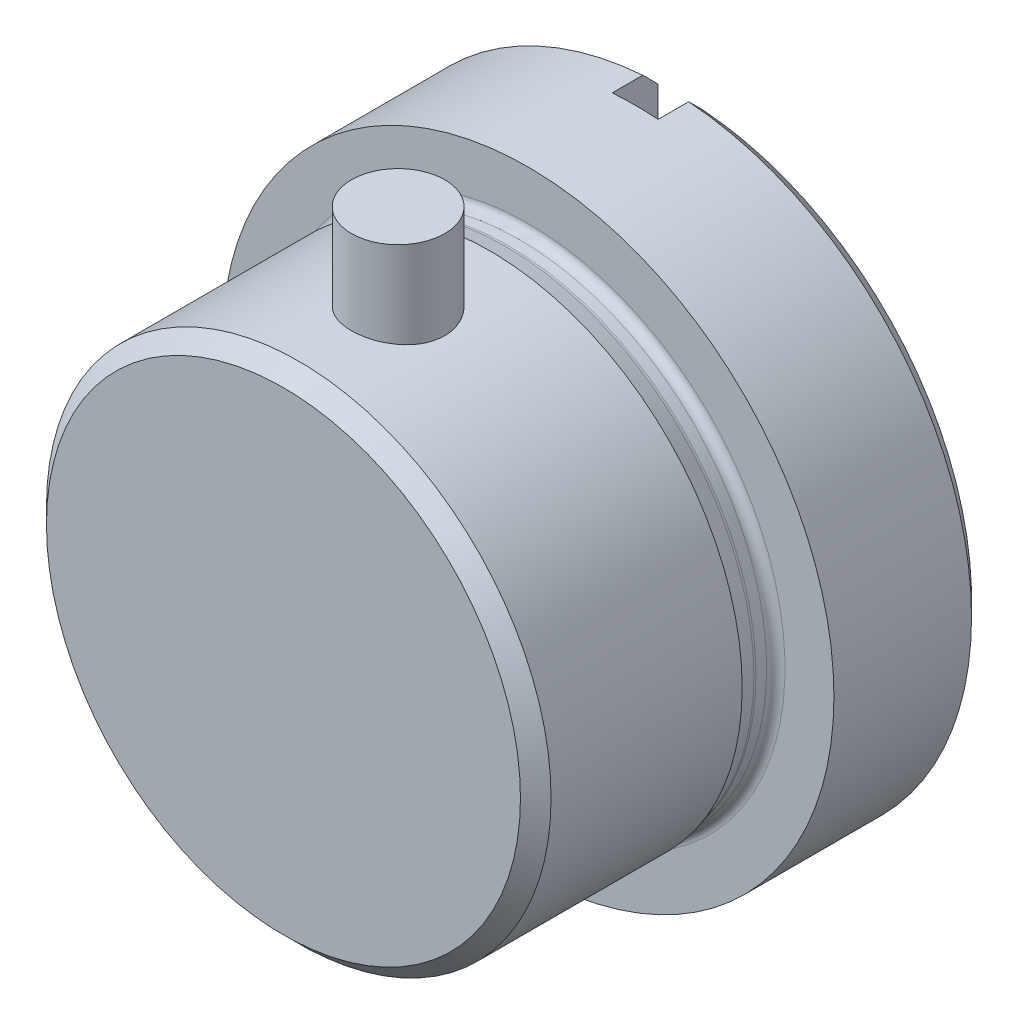
ISO-10303-21;
HEADER;
FILE_DESCRIPTION(('STEP AP214'),'2;1');
FILE_NAME('part.step','',(''),(''),'','','');
FILE_SCHEMA(('AUTOMOTIVE_DESIGN { 1 0 10303 214 1 1 1 1 }'));
ENDSEC;
DATA;
#1=APPLICATION_CONTEXT('core data for automotive mechanical design processes');
#2=APPLICATION_PROTOCOL_DEFINITION('international standard','automotive_design',2000,#1);
#3=PRODUCT_CONTEXT('',#1,'mechanical');
#4=PRODUCT('Part','Part','',(#3));
#5=PRODUCT_RELATED_PRODUCT_CATEGORY('part','',(#4));
#6=PRODUCT_DEFINITION_FORMATION('','',#4);
#7=PRODUCT_DEFINITION_CONTEXT('part definition',#1,'design');
#8=PRODUCT_DEFINITION('design','',#6,#7);
#9=PRODUCT_DEFINITION_SHAPE('','',#8);
#10=(LENGTH_UNIT() NAMED_UNIT(*) SI_UNIT(.MILLI.,.METRE.));
#11=(NAMED_UNIT(*) PLANE_ANGLE_UNIT() SI_UNIT($,.RADIAN.));
#12=(NAMED_UNIT(*) SI_UNIT($,.STERADIAN.) SOLID_ANGLE_UNIT());
#13=UNCERTAINTY_MEASURE_WITH_UNIT(LENGTH_MEASURE(1.E-05),#10,'distance_accuracy_value','');
#14=(GEOMETRIC_REPRESENTATION_CONTEXT(3) GLOBAL_UNCERTAINTY_ASSIGNED_CONTEXT((#13)) GLOBAL_UNIT_ASSIGNED_CONTEXT((#10,
#11,#12)) REPRESENTATION_CONTEXT('',''));
#15=CARTESIAN_POINT('',(0.,0.,0.));
#16=DIRECTION('',(0.,0.,1.));
#17=DIRECTION('',(1.,0.,0.));
#18=AXIS2_PLACEMENT_3D('',#15,#16,#17);
#19=CARTESIAN_POINT('',(0.,11.,-7.5));
#20=DIRECTION('',(0.,1.,0.));
#21=DIRECTION('',(0.,0.,1.));
#22=AXIS2_PLACEMENT_3D('',#19,#20,#21);
#23=CYLINDRICAL_SURFACE('',#22,3.05);
#24=CARTESIAN_POINT('',(0.,11.,-7.5));
#25=DIRECTION('',(0.,1.,0.));
#26=DIRECTION('',(0.,0.,1.));
#27=AXIS2_PLACEMENT_3D('',#24,#25,#26);
#28=CIRCLE('',#27,3.05);
#29=CARTESIAN_POINT('',(0.,11.,-4.45));
#30=VERTEX_POINT('',#29);
#31=EDGE_CURVE('E11',#30,#30,#28,.T.);
#32=ORIENTED_EDGE('',*,*,#31,.T.);
#33=EDGE_LOOP('',(#32));
#34=FACE_BOUND('',#33,.T.);
#35=CARTESIAN_POINT('',(0.,22.,-7.5));
#36=DIRECTION('',(0.,1.,0.));
#37=DIRECTION('',(0.,0.,1.));
#38=AXIS2_PLACEMENT_3D('',#35,#36,#37);
#39=CIRCLE('',#38,3.05);
#40=CARTESIAN_POINT('',(0.,22.,-4.45));
#41=VERTEX_POINT('',#40);
#42=EDGE_CURVE('E52',#41,#41,#39,.T.);
#43=ORIENTED_EDGE('',*,*,#42,.F.);
#44=EDGE_LOOP('',(#43));
#45=FACE_BOUND('',#44,.T.);
#46=ADVANCED_FACE('F46',(#34,#45),#23,.T.);
#47=CARTESIAN_POINT('',(0.,11.,-7.5));
#48=DIRECTION('',(0.,1.,0.));
#49=DIRECTION('',(0.,0.,1.));
#50=AXIS2_PLACEMENT_3D('',#47,#48,#49);
#51=PLANE('',#50);
#52=ORIENTED_EDGE('',*,*,#31,.F.);
#53=EDGE_LOOP('',(#52));
#54=FACE_BOUND('',#53,.T.);
#55=ADVANCED_FACE('F61',(#54),#51,.F.);
#56=CARTESIAN_POINT('',(0.,22.,-7.5));
#57=DIRECTION('',(0.,1.,0.));
#58=DIRECTION('',(0.,0.,1.));
#59=AXIS2_PLACEMENT_3D('',#56,#57,#58);
#60=PLANE('',#59);
#61=ORIENTED_EDGE('',*,*,#42,.T.);
#62=EDGE_LOOP('',(#61));
#63=FACE_BOUND('',#62,.T.);
#64=ADVANCED_FACE('F58',(#63),#60,.T.);
#65=CLOSED_SHELL('',(#46,#55,#64));
#66=MANIFOLD_SOLID_BREP('B2',#65);
#67=CARTESIAN_POINT('',(0.,20.,-26.));
#68=DIRECTION('',(0.,0.,1.));
#69=DIRECTION('',(1.,0.,0.));
#70=AXIS2_PLACEMENT_3D('',#67,#68,#69);
#71=PLANE('',#70);
#72=DIRECTION('',(0.,-1.,0.));
#73=VECTOR('',#72,1.);
#74=CARTESIAN_POINT('',(1.5,20.,-26.));
#75=LINE('',#74,#73);
#76=CARTESIAN_POINT('',(1.5,18.9406969248758,-26.));
#77=VERTEX_POINT('',#76);
#78=CARTESIAN_POINT('',(1.5,-18.9406969248758,-26.));
#79=VERTEX_POINT('',#78);
#80=EDGE_CURVE('E169',#77,#79,#75,.T.);
#81=ORIENTED_EDGE('',*,*,#80,.F.);
#82=CARTESIAN_POINT('',(0.,0.,-26.));
#83=DIRECTION('',(0.,0.,1.));
#84=DIRECTION('',(1.,0.,0.));
#85=AXIS2_PLACEMENT_3D('',#82,#83,#84);
#86=CIRCLE('',#85,19.);
#87=EDGE_CURVE('E273',#77,#79,#86,.F.);
#88=ORIENTED_EDGE('',*,*,#87,.T.);
#89=EDGE_LOOP('',(#81,#88));
#90=FACE_BOUND('',#89,.T.);
#91=ADVANCED_FACE('F86',(#90),#71,.F.);
#92=CARTESIAN_POINT('',(0.,0.,0.));
#93=DIRECTION('',(0.,0.,-1.));
#94=DIRECTION('',(-1.,0.,0.));
#95=AXIS2_PLACEMENT_3D('',#92,#93,#94);
#96=PLANE('',#95);
#97=CARTESIAN_POINT('',(0.,0.,0.));
#98=DIRECTION('',(0.,0.,-1.));
#99=DIRECTION('',(-1.,0.,0.));
#100=AXIS2_PLACEMENT_3D('',#97,#98,#99);
#101=CIRCLE('',#100,15.5);
#102=CARTESIAN_POINT('',(-15.5,0.,0.));
#103=VERTEX_POINT('',#102);
#104=EDGE_CURVE('E179',#103,#103,#101,.F.);
#105=ORIENTED_EDGE('',*,*,#104,.T.);
#106=EDGE_LOOP('',(#105));
#107=FACE_BOUND('',#106,.T.);
#108=ADVANCED_FACE('F247',(#107),#96,.F.);
#109=CARTESIAN_POINT('',(0.,0.,0.));
#110=DIRECTION('',(0.,0.,1.));
#111=DIRECTION('',(1.,0.,0.));
#112=AXIS2_PLACEMENT_3D('',#109,#110,#111);
#113=CYLINDRICAL_SURFACE('',#112,16.5);
#114=CARTESIAN_POINT('',(0.,0.,-13.5));
#115=DIRECTION('',(0.,0.,1.));
#116=DIRECTION('',(1.,0.,0.));
#117=AXIS2_PLACEMENT_3D('',#114,#115,#116);
#118=CIRCLE('',#117,16.5);
#119=CARTESIAN_POINT('',(16.5,0.,-13.5));
#120=VERTEX_POINT('',#119);
#121=EDGE_CURVE('E167',#120,#120,#118,.T.);
#122=ORIENTED_EDGE('',*,*,#121,.T.);
#123=EDGE_LOOP('',(#122));
#124=FACE_BOUND('',#123,.T.);
#125=CARTESIAN_POINT('',(0.,0.,-0.999999999999994));
#126=DIRECTION('',(0.,0.,-1.));
#127=DIRECTION('',(-1.,0.,0.));
#128=AXIS2_PLACEMENT_3D('',#125,#126,#127);
#129=CIRCLE('',#128,16.5);
#130=CARTESIAN_POINT('',(-16.5,0.,-0.999999999999994));
#131=VERTEX_POINT('',#130);
#132=EDGE_CURVE('E182',#131,#131,#129,.T.);
#133=ORIENTED_EDGE('',*,*,#132,.T.);
#134=EDGE_LOOP('',(#133));
#135=FACE_BOUND('',#134,.T.);
#136=ADVANCED_FACE('F244',(#124,#135),#113,.T.);
#137=CARTESIAN_POINT('',(0.,0.,0.));
#138=DIRECTION('',(0.,0.,-1.));
#139=DIRECTION('',(-1.,0.,0.));
#140=AXIS2_PLACEMENT_3D('',#137,#138,#139);
#141=CONICAL_SURFACE('',#140,15.5,0.785398163397448);
#142=ORIENTED_EDGE('',*,*,#132,.F.);
#143=EDGE_LOOP('',(#142));
#144=FACE_BOUND('',#143,.T.);
#145=ORIENTED_EDGE('',*,*,#104,.F.);
#146=EDGE_LOOP('',(#145));
#147=FACE_BOUND('',#146,.T.);
#148=ADVANCED_FACE('F233',(#144,#147),#141,.T.);
#149=CARTESIAN_POINT('',(0.,0.,-13.5));
#150=DIRECTION('',(0.,0.,-1.));
#151=DIRECTION('',(-1.,0.,0.));
#152=AXIS2_PLACEMENT_3D('',#149,#150,#151);
#153=CYLINDRICAL_SURFACE('',#152,16.2);
#154=CARTESIAN_POINT('',(0.,0.,-15.4));
#155=DIRECTION('',(0.,0.,-1.));
#156=DIRECTION('',(-1.,0.,0.));
#157=AXIS2_PLACEMENT_3D('',#154,#155,#156);
#158=CIRCLE('',#157,16.2);
#159=CARTESIAN_POINT('',(-16.2,0.,-15.4));
#160=VERTEX_POINT('',#159);
#161=EDGE_CURVE('E188',#160,#160,#158,.F.);
#162=ORIENTED_EDGE('',*,*,#161,.T.);
#163=EDGE_LOOP('',(#162));
#164=FACE_BOUND('',#163,.T.);
#165=CARTESIAN_POINT('',(0.,0.,-14.6986067408231));
#166=DIRECTION('',(0.,0.,-1.));
#167=DIRECTION('',(-1.,0.,0.));
#168=AXIS2_PLACEMENT_3D('',#165,#166,#167);
#169=CIRCLE('',#168,16.2);
#170=CARTESIAN_POINT('',(-16.2,0.,-14.6986067408231));
#171=VERTEX_POINT('',#170);
#172=EDGE_CURVE('E185',#171,#171,#169,.T.);
#173=ORIENTED_EDGE('',*,*,#172,.T.);
#174=EDGE_LOOP('',(#173));
#175=FACE_BOUND('',#174,.T.);
#176=ADVANCED_FACE('F228',(#164,#175),#153,.T.);
#177=DIRECTION('',(0.,1.,0.));
#178=VECTOR('',#177,1.);
#179=CARTESIAN_POINT('',(-1.5,20.,-26.));
#180=LINE('',#179,#178);
#181=CARTESIAN_POINT('',(-1.5,-18.9406969248758,-26.));
#182=VERTEX_POINT('',#181);
#183=CARTESIAN_POINT('',(-1.5,18.9406969248758,-26.));
#184=VERTEX_POINT('',#183);
#185=EDGE_CURVE('E165',#182,#184,#180,.T.);
#186=ORIENTED_EDGE('',*,*,#185,.F.);
#187=CARTESIAN_POINT('',(0.,0.,-26.));
#188=DIRECTION('',(0.,0.,1.));
#189=DIRECTION('',(1.,0.,0.));
#190=AXIS2_PLACEMENT_3D('',#187,#188,#189);
#191=CIRCLE('',#190,19.);
#192=EDGE_CURVE('E44',#182,#184,#191,.F.);
#193=ORIENTED_EDGE('',*,*,#192,.T.);
#194=EDGE_LOOP('',(#186,#193));
#195=FACE_BOUND('',#194,.T.);
#196=ADVANCED_FACE('F232',(#195),#71,.F.);
#197=CARTESIAN_POINT('',(0.,0.,0.));
#198=DIRECTION('',(0.,0.,1.));
#199=DIRECTION('',(1.,0.,0.));
#200=AXIS2_PLACEMENT_3D('',#197,#198,#199);
#201=CYLINDRICAL_SURFACE('',#200,20.);
#202=DIRECTION('',(0.,0.,1.));
#203=VECTOR('',#202,1.);
#204=CARTESIAN_POINT('',(1.5,-19.9436706751791,0.));
#205=LINE('',#204,#203);
#206=CARTESIAN_POINT('',(1.5,-19.9436706751791,-23.));
#207=VERTEX_POINT('',#206);
#208=CARTESIAN_POINT('',(1.5,-19.9436706751791,-25.));
#209=VERTEX_POINT('',#208);
#210=EDGE_CURVE('E160',#207,#209,#205,.F.);
#211=ORIENTED_EDGE('',*,*,#210,.T.);
#212=CARTESIAN_POINT('',(0.,0.,-25.));
#213=DIRECTION('',(0.,0.,1.));
#214=DIRECTION('',(1.,0.,0.));
#215=AXIS2_PLACEMENT_3D('',#212,#213,#214);
#216=CIRCLE('',#215,20.);
#217=CARTESIAN_POINT('',(1.5,19.9436706751791,-25.));
#218=VERTEX_POINT('',#217);
#219=EDGE_CURVE('E146',#209,#218,#216,.T.);
#220=ORIENTED_EDGE('',*,*,#219,.T.);
#221=DIRECTION('',(0.,0.,1.));
#222=VECTOR('',#221,1.);
#223=CARTESIAN_POINT('',(1.5,19.9436706751791,0.));
#224=LINE('',#223,#222);
#225=CARTESIAN_POINT('',(1.5,19.9436706751791,-23.));
#226=VERTEX_POINT('',#225);
#227=EDGE_CURVE('E137',#218,#226,#224,.T.);
#228=ORIENTED_EDGE('',*,*,#227,.T.);
#229=CARTESIAN_POINT('',(0.,0.,-23.));
#230=DIRECTION('',(0.,0.,-1.));
#231=DIRECTION('',(-1.,0.,0.));
#232=AXIS2_PLACEMENT_3D('',#229,#230,#231);
#233=CIRCLE('',#232,20.);
#234=CARTESIAN_POINT('',(-1.5,19.9436706751791,-23.));
#235=VERTEX_POINT('',#234);
#236=EDGE_CURVE('E143',#235,#226,#233,.T.);
#237=ORIENTED_EDGE('',*,*,#236,.F.);
#238=DIRECTION('',(0.,0.,1.));
#239=VECTOR('',#238,1.);
#240=CARTESIAN_POINT('',(-1.5,19.9436706751791,0.));
#241=LINE('',#240,#239);
#242=CARTESIAN_POINT('',(-1.5,19.9436706751791,-25.));
#243=VERTEX_POINT('',#242);
#244=EDGE_CURVE('E150',#235,#243,#241,.F.);
#245=ORIENTED_EDGE('',*,*,#244,.T.);
#246=CARTESIAN_POINT('',(0.,0.,-25.));
#247=DIRECTION('',(0.,0.,1.));
#248=DIRECTION('',(1.,0.,0.));
#249=AXIS2_PLACEMENT_3D('',#246,#247,#248);
#250=CIRCLE('',#249,20.);
#251=CARTESIAN_POINT('',(-1.5,-19.9436706751791,-25.));
#252=VERTEX_POINT('',#251);
#253=EDGE_CURVE('E149',#243,#252,#250,.T.);
#254=ORIENTED_EDGE('',*,*,#253,.T.);
#255=DIRECTION('',(0.,0.,1.));
#256=VECTOR('',#255,1.);
#257=CARTESIAN_POINT('',(-1.5,-19.9436706751791,0.));
#258=LINE('',#257,#256);
#259=CARTESIAN_POINT('',(-1.5,-19.9436706751791,-23.));
#260=VERTEX_POINT('',#259);
#261=EDGE_CURVE('E197',#252,#260,#258,.T.);
#262=ORIENTED_EDGE('',*,*,#261,.T.);
#263=EDGE_CURVE('E162',#207,#260,#233,.T.);
#264=ORIENTED_EDGE('',*,*,#263,.F.);
#265=EDGE_LOOP('',(#211,#220,#228,#237,#245,#254,#262,#264));
#266=FACE_BOUND('',#265,.T.);
#267=CARTESIAN_POINT('',(0.,0.,-16.));
#268=DIRECTION('',(0.,0.,1.));
#269=DIRECTION('',(1.,0.,0.));
#270=AXIS2_PLACEMENT_3D('',#267,#268,#269);
#271=CIRCLE('',#270,20.);
#272=CARTESIAN_POINT('',(20.,0.,-16.));
#273=VERTEX_POINT('',#272);
#274=EDGE_CURVE('E176',#273,#273,#271,.T.);
#275=ORIENTED_EDGE('',*,*,#274,.F.);
#276=EDGE_LOOP('',(#275));
#277=FACE_BOUND('',#276,.T.);
#278=ADVANCED_FACE('F140',(#266,#277),#201,.T.);
#279=CARTESIAN_POINT('',(0.,16.5,-16.));
#280=DIRECTION('',(0.,0.,-1.));
#281=DIRECTION('',(-1.,0.,0.));
#282=AXIS2_PLACEMENT_3D('',#279,#280,#281);
#283=PLANE('',#282);
#284=CARTESIAN_POINT('',(0.,0.,-16.));
#285=DIRECTION('',(0.,0.,-1.));
#286=DIRECTION('',(-1.,0.,0.));
#287=AXIS2_PLACEMENT_3D('',#284,#285,#286);
#288=CIRCLE('',#287,16.8);
#289=CARTESIAN_POINT('',(-16.8,0.,-16.));
#290=VERTEX_POINT('',#289);
#291=EDGE_CURVE('E191',#290,#290,#288,.T.);
#292=ORIENTED_EDGE('',*,*,#291,.T.);
#293=EDGE_LOOP('',(#292));
#294=FACE_BOUND('',#293,.T.);
#295=ORIENTED_EDGE('',*,*,#274,.T.);
#296=EDGE_LOOP('',(#295));
#297=FACE_BOUND('',#296,.T.);
#298=ADVANCED_FACE('F239',(#294,#297),#283,.F.);
#299=CARTESIAN_POINT('',(0.,0.,-13.5));
#300=DIRECTION('',(0.,0.,1.));
#301=DIRECTION('',(1.,0.,0.));
#302=AXIS2_PLACEMENT_3D('',#299,#300,#301);
#303=CONICAL_SURFACE('',#302,16.5,0.261799387799138);
#304=CARTESIAN_POINT('',(0.,0.,-14.5433153137616));
#305=DIRECTION('',(0.,0.,1.));
#306=DIRECTION('',(1.,0.,0.));
#307=AXIS2_PLACEMENT_3D('',#304,#305,#306);
#308=CIRCLE('',#307,16.2204445042266);
#309=CARTESIAN_POINT('',(16.2204445042266,0.,-14.5433153137616));
#310=VERTEX_POINT('',#309);
#311=EDGE_CURVE('E194',#310,#310,#308,.T.);
#312=ORIENTED_EDGE('',*,*,#311,.T.);
#313=EDGE_LOOP('',(#312));
#314=FACE_BOUND('',#313,.T.);
#315=ORIENTED_EDGE('',*,*,#121,.F.);
#316=EDGE_LOOP('',(#315));
#317=FACE_BOUND('',#316,.T.);
#318=ADVANCED_FACE('F242',(#314,#317),#303,.T.);
#319=CARTESIAN_POINT('',(0.,0.,-15.4));
#320=DIRECTION('',(0.,0.,-1.));
#321=DIRECTION('',(-1.,0.,0.));
#322=AXIS2_PLACEMENT_3D('',#319,#320,#321);
#323=TOROIDAL_SURFACE('',#322,16.8,0.6);
#324=ORIENTED_EDGE('',*,*,#291,.F.);
#325=EDGE_LOOP('',(#324));
#326=FACE_BOUND('',#325,.T.);
#327=ORIENTED_EDGE('',*,*,#161,.F.);
#328=EDGE_LOOP('',(#327));
#329=FACE_BOUND('',#328,.T.);
#330=ADVANCED_FACE('F257',(#326,#329),#323,.F.);
#331=CARTESIAN_POINT('',(0.,0.,-14.6986067408231));
#332=DIRECTION('',(0.,0.,-1.));
#333=DIRECTION('',(-1.,0.,0.));
#334=AXIS2_PLACEMENT_3D('',#331,#332,#333);
#335=TOROIDAL_SURFACE('',#334,16.8,0.6);
#336=ORIENTED_EDGE('',*,*,#311,.F.);
#337=EDGE_LOOP('',(#336));
#338=FACE_BOUND('',#337,.T.);
#339=ORIENTED_EDGE('',*,*,#172,.F.);
#340=EDGE_LOOP('',(#339));
#341=FACE_BOUND('',#340,.T.);
#342=ADVANCED_FACE('F225',(#338,#341),#335,.F.);
#343=CARTESIAN_POINT('',(1.5,20.,-23.));
#344=DIRECTION('',(1.,0.,0.));
#345=DIRECTION('',(0.,1.,0.));
#346=AXIS2_PLACEMENT_3D('',#343,#344,#345);
#347=PLANE('',#346);
#348=ORIENTED_EDGE('',*,*,#227,.F.);
#349=CARTESIAN_POINT('',(1.5,19.9436706751791,-25.));
#350=CARTESIAN_POINT('',(1.5,19.7765211106424,-25.1666794316821));
#351=CARTESIAN_POINT('',(1.5,19.6093651825186,-25.3333524808534));
#352=CARTESIAN_POINT('',(1.5,19.2750405990841,-25.6666858141868));
#353=CARTESIAN_POINT('',(1.5,19.1078719437735,-25.8333460983488));
#354=CARTESIAN_POINT('',(1.5,18.9406969248758,-26.));
#355=B_SPLINE_CURVE_WITH_KNOTS('',3,(#349,#350,#351,#352,#353,#354),.UNSPECIFIED.,.F.,.F.,(4,2,
4),(0.,0.708158941652912,1.41631788335877),.UNSPECIFIED.);
#356=EDGE_CURVE('E211',#218,#77,#355,.T.);
#357=ORIENTED_EDGE('',*,*,#356,.T.);
#358=ORIENTED_EDGE('',*,*,#80,.T.);
#359=CARTESIAN_POINT('',(1.5,-18.9406969248758,-26.));
#360=CARTESIAN_POINT('',(1.5,-19.1078719437735,-25.8333460983488));
#361=CARTESIAN_POINT('',(1.5,-19.2750405990841,-25.6666858141868));
#362=CARTESIAN_POINT('',(1.5,-19.6093651825186,-25.3333524808534));
#363=CARTESIAN_POINT('',(1.5,-19.7765211106424,-25.1666794316821));
#364=CARTESIAN_POINT('',(1.5,-19.9436706751791,-25.));
#365=B_SPLINE_CURVE_WITH_KNOTS('',3,(#359,#360,#361,#362,#363,#364),.UNSPECIFIED.,.F.,.F.,(4,2,
4),(0.,0.708158941705857,1.41631788335877),.UNSPECIFIED.);
#366=EDGE_CURVE('E204',#79,#209,#365,.T.);
#367=ORIENTED_EDGE('',*,*,#366,.T.);
#368=ORIENTED_EDGE('',*,*,#210,.F.);
#369=DIRECTION('',(0.,-1.,0.));
#370=VECTOR('',#369,1.);
#371=CARTESIAN_POINT('',(1.5,20.,-23.));
#372=LINE('',#371,#370);
#373=EDGE_CURVE('E157',#226,#207,#372,.T.);
#374=ORIENTED_EDGE('',*,*,#373,.F.);
#375=EDGE_LOOP('',(#348,#357,#358,#367,#368,#374));
#376=FACE_BOUND('',#375,.T.);
#377=ADVANCED_FACE('F164',(#376),#347,.F.);
#378=CARTESIAN_POINT('',(-1.5,20.,-23.));
#379=DIRECTION('',(-1.,0.,0.));
#380=DIRECTION('',(0.,-1.,0.));
#381=AXIS2_PLACEMENT_3D('',#378,#379,#380);
#382=PLANE('',#381);
#383=ORIENTED_EDGE('',*,*,#261,.F.);
#384=CARTESIAN_POINT('',(-1.5,-19.9436706751791,-25.));
#385=CARTESIAN_POINT('',(-1.5,-19.7765211106424,-25.1666794316821));
#386=CARTESIAN_POINT('',(-1.5,-19.6093651825186,-25.3333524808534));
#387=CARTESIAN_POINT('',(-1.5,-19.2750405990841,-25.6666858141868));
#388=CARTESIAN_POINT('',(-1.5,-19.1078719437735,-25.8333460983488));
#389=CARTESIAN_POINT('',(-1.5,-18.9406969248758,-26.));
#390=B_SPLINE_CURVE_WITH_KNOTS('',3,(#384,#385,#386,#387,#388,#389),.UNSPECIFIED.,.F.,.F.,(4,2,
4),(0.,0.708158941652915,1.41631788335877),.UNSPECIFIED.);
#391=EDGE_CURVE('E95',#252,#182,#390,.T.);
#392=ORIENTED_EDGE('',*,*,#391,.T.);
#393=ORIENTED_EDGE('',*,*,#185,.T.);
#394=CARTESIAN_POINT('',(-1.5,18.9406969248758,-26.));
#395=CARTESIAN_POINT('',(-1.5,19.1078719437735,-25.8333460983488));
#396=CARTESIAN_POINT('',(-1.5,19.2750405990841,-25.6666858141868));
#397=CARTESIAN_POINT('',(-1.5,19.6093651825186,-25.3333524808534));
#398=CARTESIAN_POINT('',(-1.5,19.7765211106424,-25.1666794316821));
#399=CARTESIAN_POINT('',(-1.5,19.9436706751791,-25.));
#400=B_SPLINE_CURVE_WITH_KNOTS('',3,(#394,#395,#396,#397,#398,#399),.UNSPECIFIED.,.F.,.F.,(4,2,
4),(0.,0.708158941705857,1.41631788335877),.UNSPECIFIED.);
#401=EDGE_CURVE('E276',#184,#243,#400,.T.);
#402=ORIENTED_EDGE('',*,*,#401,.T.);
#403=ORIENTED_EDGE('',*,*,#244,.F.);
#404=DIRECTION('',(0.,1.,0.));
#405=VECTOR('',#404,1.);
#406=CARTESIAN_POINT('',(-1.5,20.,-23.));
#407=LINE('',#406,#405);
#408=EDGE_CURVE('E159',#260,#235,#407,.T.);
#409=ORIENTED_EDGE('',*,*,#408,.F.);
#410=EDGE_LOOP('',(#383,#392,#393,#402,#403,#409));
#411=FACE_BOUND('',#410,.T.);
#412=ADVANCED_FACE('F224',(#411),#382,.F.);
#413=CARTESIAN_POINT('',(0.,0.,-23.));
#414=DIRECTION('',(0.,0.,-1.));
#415=DIRECTION('',(-1.,0.,0.));
#416=AXIS2_PLACEMENT_3D('',#413,#414,#415);
#417=PLANE('',#416);
#418=ORIENTED_EDGE('',*,*,#408,.T.);
#419=ORIENTED_EDGE('',*,*,#236,.T.);
#420=ORIENTED_EDGE('',*,*,#373,.T.);
#421=ORIENTED_EDGE('',*,*,#263,.T.);
#422=EDGE_LOOP('',(#418,#419,#420,#421));
#423=FACE_BOUND('',#422,.T.);
#424=ADVANCED_FACE('F155',(#423),#417,.T.);
#425=CARTESIAN_POINT('',(0.,0.,-25.));
#426=DIRECTION('',(0.,0.,1.));
#427=DIRECTION('',(1.,0.,0.));
#428=AXIS2_PLACEMENT_3D('',#425,#426,#427);
#429=CONICAL_SURFACE('',#428,20.,0.78539816339745);
#430=ORIENTED_EDGE('',*,*,#366,.F.);
#431=ORIENTED_EDGE('',*,*,#87,.F.);
#432=ORIENTED_EDGE('',*,*,#356,.F.);
#433=ORIENTED_EDGE('',*,*,#219,.F.);
#434=EDGE_LOOP('',(#430,#431,#432,#433));
#435=FACE_BOUND('',#434,.T.);
#436=ADVANCED_FACE('F217',(#435),#429,.T.);
#437=CARTESIAN_POINT('',(0.,0.,-25.));
#438=DIRECTION('',(0.,0.,1.));
#439=DIRECTION('',(1.,0.,0.));
#440=AXIS2_PLACEMENT_3D('',#437,#438,#439);
#441=CONICAL_SURFACE('',#440,20.,0.78539816339745);
#442=ORIENTED_EDGE('',*,*,#401,.F.);
#443=ORIENTED_EDGE('',*,*,#192,.F.);
#444=ORIENTED_EDGE('',*,*,#391,.F.);
#445=ORIENTED_EDGE('',*,*,#253,.F.);
#446=EDGE_LOOP('',(#442,#443,#444,#445));
#447=FACE_BOUND('',#446,.T.);
#448=ADVANCED_FACE('F88',(#447),#441,.T.);
#449=CLOSED_SHELL('',(#91,#108,#136,#148,#176,#196,#278,#298,#318,#330,#342,#377,#412,#424,#436,#448));
#450=MANIFOLD_SOLID_BREP('B6',#449);
#451=ADVANCED_BREP_SHAPE_REPRESENTATION('',(#18,#66,#450),#14);
#452=SHAPE_DEFINITION_REPRESENTATION(#9,#451);
ENDSEC;
END-ISO-10303-21;
